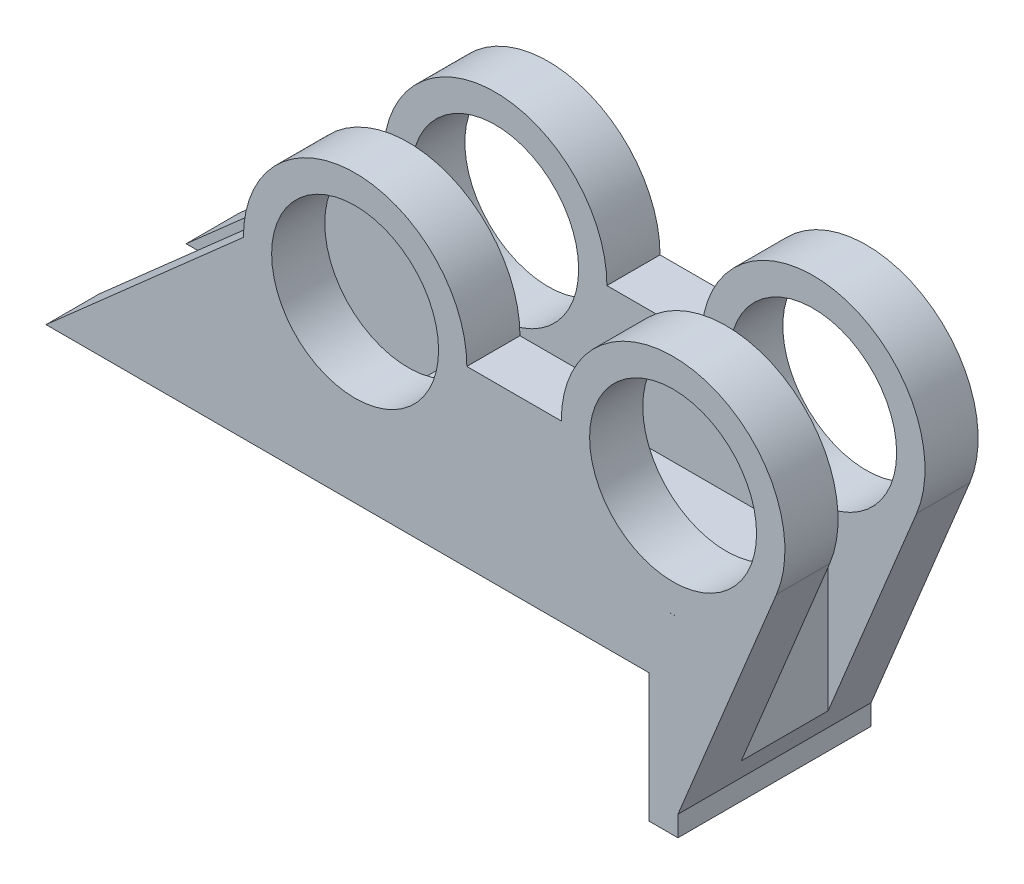
ISO-10303-21;
HEADER;
FILE_DESCRIPTION(('STEP AP214'),'2;1');
FILE_NAME('part.step','',(''),(''),'','','');
FILE_SCHEMA(('AUTOMOTIVE_DESIGN { 1 0 10303 214 1 1 1 1 }'));
ENDSEC;
DATA;
#1=APPLICATION_CONTEXT('core data for automotive mechanical design processes');
#2=APPLICATION_PROTOCOL_DEFINITION('international standard','automotive_design',2000,#1);
#3=PRODUCT_CONTEXT('',#1,'mechanical');
#4=PRODUCT('Part','Part','',(#3));
#5=PRODUCT_RELATED_PRODUCT_CATEGORY('part','',(#4));
#6=PRODUCT_DEFINITION_FORMATION('','',#4);
#7=PRODUCT_DEFINITION_CONTEXT('part definition',#1,'design');
#8=PRODUCT_DEFINITION('design','',#6,#7);
#9=PRODUCT_DEFINITION_SHAPE('','',#8);
#10=(LENGTH_UNIT() NAMED_UNIT(*) SI_UNIT(.MILLI.,.METRE.));
#11=(NAMED_UNIT(*) PLANE_ANGLE_UNIT() SI_UNIT($,.RADIAN.));
#12=(NAMED_UNIT(*) SI_UNIT($,.STERADIAN.) SOLID_ANGLE_UNIT());
#13=UNCERTAINTY_MEASURE_WITH_UNIT(LENGTH_MEASURE(1.E-05),#10,'distance_accuracy_value','');
#14=(GEOMETRIC_REPRESENTATION_CONTEXT(3) GLOBAL_UNCERTAINTY_ASSIGNED_CONTEXT((#13)) GLOBAL_UNIT_ASSIGNED_CONTEXT((#10,
#11,#12)) REPRESENTATION_CONTEXT('',''));
#15=CARTESIAN_POINT('',(0.,0.,0.));
#16=DIRECTION('',(0.,0.,1.));
#17=DIRECTION('',(1.,0.,0.));
#18=AXIS2_PLACEMENT_3D('',#15,#16,#17);
#19=CARTESIAN_POINT('',(-28.5338297114202,32.3262462591213,25.4));
#20=DIRECTION('',(0.661760778149654,-0.749715060874973,0.));
#21=DIRECTION('',(0.749715060874973,0.661760778149654,0.));
#22=AXIS2_PLACEMENT_3D('',#19,#20,#21);
#23=PLANE('',#22);
#24=DIRECTION('',(0.749715060874973,0.661760778149654,0.));
#25=VECTOR('',#24,1.);
#26=CARTESIAN_POINT('',(-28.5338297114202,32.3262462591213,18.415));
#27=LINE('',#26,#25);
#28=CARTESIAN_POINT('',(-45.8915533275694,17.0048777998512,18.415));
#29=VERTEX_POINT('',#28);
#30=CARTESIAN_POINT('',(-19.9469963419217,39.9056985457125,18.415));
#31=VERTEX_POINT('',#30);
#32=EDGE_CURVE('E385',#29,#31,#27,.T.);
#33=ORIENTED_EDGE('',*,*,#32,.F.);
#34=DIRECTION('',(0.,0.,-1.));
#35=VECTOR('',#34,1.);
#36=CARTESIAN_POINT('',(-45.8915533275694,17.0048777998512,25.4));
#37=LINE('',#36,#35);
#38=CARTESIAN_POINT('',(-45.8915533275694,17.0048777998512,25.4));
#39=VERTEX_POINT('',#38);
#40=EDGE_CURVE('E278',#39,#29,#37,.T.);
#41=ORIENTED_EDGE('',*,*,#40,.F.);
#42=DIRECTION('',(-0.749715060874973,-0.661760778149654,0.));
#43=VECTOR('',#42,1.);
#44=CARTESIAN_POINT('',(-28.5338297114202,32.3262462591213,25.4));
#45=LINE('',#44,#43);
#46=CARTESIAN_POINT('',(-19.9469963419217,39.9056985457125,25.4));
#47=VERTEX_POINT('',#46);
#48=EDGE_CURVE('E441',#47,#39,#45,.T.);
#49=ORIENTED_EDGE('',*,*,#48,.F.);
#50=CARTESIAN_POINT('',(-19.9469963419217,39.9056985457125,25.4));
#51=DIRECTION('',(0.,0.,-1.));
#52=VECTOR('',#51,1.);
#53=LINE('',#50,#52);
#54=EDGE_CURVE('E559',#47,#31,#53,.T.);
#55=ORIENTED_EDGE('',*,*,#54,.T.);
#56=EDGE_LOOP('',(#33,#41,#49,#55));
#57=FACE_BOUND('',#56,.T.);
#58=ADVANCED_FACE('F101',(#57),#23,.F.);
#59=CARTESIAN_POINT('',(-45.8915533275694,17.0048777998512,6.985));
#60=VERTEX_POINT('',#59);
#61=CARTESIAN_POINT('',(-45.8915533275694,17.0048777998512,0.));
#62=VERTEX_POINT('',#61);
#63=EDGE_CURVE('E535',#60,#62,#37,.T.);
#64=ORIENTED_EDGE('',*,*,#63,.F.);
#65=DIRECTION('',(-0.749715060874973,-0.661760778149654,0.));
#66=VECTOR('',#65,1.);
#67=CARTESIAN_POINT('',(-28.5338297114202,32.3262462591213,6.985));
#68=LINE('',#67,#66);
#69=CARTESIAN_POINT('',(-19.9469963419217,39.9056985457125,6.985));
#70=VERTEX_POINT('',#69);
#71=EDGE_CURVE('E352',#70,#60,#68,.T.);
#72=ORIENTED_EDGE('',*,*,#71,.F.);
#73=CARTESIAN_POINT('',(-19.9469963419217,39.9056985457125,6.985));
#74=DIRECTION('',(0.,0.,-1.));
#75=VECTOR('',#74,1.);
#76=LINE('',#73,#75);
#77=CARTESIAN_POINT('',(-19.9469963419217,39.9056985457125,0.));
#78=VERTEX_POINT('',#77);
#79=EDGE_CURVE('E538',#70,#78,#76,.T.);
#80=ORIENTED_EDGE('',*,*,#79,.T.);
#81=DIRECTION('',(-0.749715060874973,-0.661760778149654,0.));
#82=VECTOR('',#81,1.);
#83=CARTESIAN_POINT('',(-28.5338297114202,32.3262462591213,0.));
#84=LINE('',#83,#82);
#85=EDGE_CURVE('E484',#78,#62,#84,.T.);
#86=ORIENTED_EDGE('',*,*,#85,.T.);
#87=EDGE_LOOP('',(#64,#72,#80,#86));
#88=FACE_BOUND('',#87,.T.);
#89=ADVANCED_FACE('F575',(#88),#23,.F.);
#90=CARTESIAN_POINT('',(0.,17.0048777998512,25.4));
#91=DIRECTION('',(0.,1.,0.));
#92=DIRECTION('',(0.,0.,1.));
#93=AXIS2_PLACEMENT_3D('',#90,#91,#92);
#94=PLANE('',#93);
#95=CARTESIAN_POINT('',(16.208214309476,17.0048777998512,12.7));
#96=DIRECTION('',(0.,1.,0.));
#97=DIRECTION('',(0.,0.,1.));
#98=AXIS2_PLACEMENT_3D('',#95,#96,#97);
#99=CIRCLE('',#98,2.15265000000001);
#100=CARTESIAN_POINT('',(16.208214309476,17.0048777998512,14.85265));
#101=VERTEX_POINT('',#100);
#102=EDGE_CURVE('E333',#101,#101,#99,.T.);
#103=ORIENTED_EDGE('',*,*,#102,.T.);
#104=EDGE_LOOP('',(#103));
#105=FACE_BOUND('',#104,.T.);
#106=CARTESIAN_POINT('',(2.23670916964207,17.0048777998512,12.7));
#107=DIRECTION('',(0.,1.,0.));
#108=DIRECTION('',(0.,0.,1.));
#109=AXIS2_PLACEMENT_3D('',#106,#107,#108);
#110=CIRCLE('',#109,2.15265);
#111=CARTESIAN_POINT('',(2.23670916964207,17.0048777998512,14.85265));
#112=VERTEX_POINT('',#111);
#113=EDGE_CURVE('E317',#112,#112,#110,.T.);
#114=ORIENTED_EDGE('',*,*,#113,.T.);
#115=EDGE_LOOP('',(#114));
#116=FACE_BOUND('',#115,.T.);
#117=DIRECTION('',(-1.,0.,0.));
#118=VECTOR('',#117,1.);
#119=CARTESIAN_POINT('',(-7.79155332756939,17.0048777998512,18.415));
#120=LINE('',#119,#118);
#121=CARTESIAN_POINT('',(-7.79155332756939,17.0048777998512,18.415));
#122=VERTEX_POINT('',#121);
#123=EDGE_CURVE('E270',#122,#29,#120,.T.);
#124=ORIENTED_EDGE('',*,*,#123,.F.);
#125=DIRECTION('',(0.,0.,-1.));
#126=VECTOR('',#125,1.);
#127=CARTESIAN_POINT('',(-7.79155332756939,17.0048777998512,18.415));
#128=LINE('',#127,#126);
#129=CARTESIAN_POINT('',(-7.79155332756939,17.0048777998512,6.985));
#130=VERTEX_POINT('',#129);
#131=EDGE_CURVE('E255',#122,#130,#128,.T.);
#132=ORIENTED_EDGE('',*,*,#131,.T.);
#133=DIRECTION('',(-1.,0.,0.));
#134=VECTOR('',#133,1.);
#135=CARTESIAN_POINT('',(-7.79155332756939,17.0048777998512,6.985));
#136=LINE('',#135,#134);
#137=EDGE_CURVE('E281',#130,#60,#136,.T.);
#138=ORIENTED_EDGE('',*,*,#137,.T.);
#139=ORIENTED_EDGE('',*,*,#63,.T.);
#140=DIRECTION('',(1.,0.,0.));
#141=VECTOR('',#140,1.);
#142=CARTESIAN_POINT('',(0.,17.0048777998512,0.));
#143=LINE('',#142,#141);
#144=CARTESIAN_POINT('',(33.3468116780541,17.0048777998512,0.));
#145=VERTEX_POINT('',#144);
#146=EDGE_CURVE('E490',#62,#145,#143,.T.);
#147=ORIENTED_EDGE('',*,*,#146,.T.);
#148=DIRECTION('',(0.,0.,-1.));
#149=VECTOR('',#148,1.);
#150=CARTESIAN_POINT('',(33.3468116780541,17.0048777998512,25.4));
#151=LINE('',#150,#149);
#152=CARTESIAN_POINT('',(33.3468116780541,17.0048777998512,25.4));
#153=VERTEX_POINT('',#152);
#154=EDGE_CURVE('E531',#153,#145,#151,.T.);
#155=ORIENTED_EDGE('',*,*,#154,.F.);
#156=DIRECTION('',(1.,0.,0.));
#157=VECTOR('',#156,1.);
#158=CARTESIAN_POINT('',(0.,17.0048777998512,25.4));
#159=LINE('',#158,#157);
#160=EDGE_CURVE('E446',#39,#153,#159,.T.);
#161=ORIENTED_EDGE('',*,*,#160,.F.);
#162=ORIENTED_EDGE('',*,*,#40,.T.);
#163=EDGE_LOOP('',(#124,#132,#138,#139,#147,#155,#161,#162));
#164=FACE_BOUND('',#163,.T.);
#165=ADVANCED_FACE('F275',(#105,#116,#164),#94,.F.);
#166=CARTESIAN_POINT('',(36.5449047795208,39.9056985457125,25.4));
#167=DIRECTION('',(0.,0.,-1.));
#168=DIRECTION('',(-1.,0.,0.));
#169=AXIS2_PLACEMENT_3D('',#166,#167,#168);
#170=CYLINDRICAL_SURFACE('',#169,14.7023778039538);
#171=DIRECTION('',(0.,0.,-1.));
#172=VECTOR('',#171,1.);
#173=CARTESIAN_POINT('',(37.182732386583,25.217162572585,25.4));
#174=LINE('',#173,#172);
#175=CARTESIAN_POINT('',(37.182732386583,25.217162572585,25.4));
#176=VERTEX_POINT('',#175);
#177=CARTESIAN_POINT('',(37.182732386583,25.217162572585,18.415));
#178=VERTEX_POINT('',#177);
#179=EDGE_CURVE('E511',#176,#178,#174,.T.);
#180=ORIENTED_EDGE('',*,*,#179,.T.);
#181=CARTESIAN_POINT('',(36.5449047795208,39.9056985457125,18.415));
#182=DIRECTION('',(0.,0.,-1.));
#183=DIRECTION('',(-1.,0.,0.));
#184=AXIS2_PLACEMENT_3D('',#181,#182,#183);
#185=CIRCLE('',#184,14.7023778039538);
#186=CARTESIAN_POINT('',(35.9070771724585,25.217162572585,18.415));
#187=VERTEX_POINT('',#186);
#188=EDGE_CURVE('E381',#178,#187,#185,.T.);
#189=ORIENTED_EDGE('',*,*,#188,.T.);
#190=DIRECTION('',(0.,0.,-1.));
#191=VECTOR('',#190,1.);
#192=CARTESIAN_POINT('',(35.9070771724585,25.217162572585,25.4));
#193=LINE('',#192,#191);
#194=CARTESIAN_POINT('',(35.9070771724585,25.217162572585,25.4));
#195=VERTEX_POINT('',#194);
#196=EDGE_CURVE('E110',#195,#187,#193,.T.);
#197=ORIENTED_EDGE('',*,*,#196,.F.);
#198=CARTESIAN_POINT('',(36.5449047795208,39.9056985457125,25.4));
#199=DIRECTION('',(0.,0.,1.));
#200=DIRECTION('',(1.,0.,0.));
#201=AXIS2_PLACEMENT_3D('',#198,#199,#200);
#202=CIRCLE('',#201,14.7023778039538);
#203=EDGE_CURVE('E460',#195,#176,#202,.T.);
#204=ORIENTED_EDGE('',*,*,#203,.T.);
#205=EDGE_LOOP('',(#180,#189,#197,#204));
#206=FACE_BOUND('',#205,.T.);
#207=ADVANCED_FACE('F647',(#206),#170,.F.);
#208=CARTESIAN_POINT('',(35.9070771724585,25.217162572585,6.985));
#209=VERTEX_POINT('',#208);
#210=CARTESIAN_POINT('',(35.9070771724585,25.217162572585,0.));
#211=VERTEX_POINT('',#210);
#212=EDGE_CURVE('E515',#209,#211,#193,.T.);
#213=ORIENTED_EDGE('',*,*,#212,.F.);
#214=CARTESIAN_POINT('',(36.5449047795208,39.9056985457125,6.985));
#215=DIRECTION('',(0.,0.,1.));
#216=DIRECTION('',(1.,0.,0.));
#217=AXIS2_PLACEMENT_3D('',#214,#215,#216);
#218=CIRCLE('',#217,14.7023778039538);
#219=CARTESIAN_POINT('',(37.182732386583,25.217162572585,6.985));
#220=VERTEX_POINT('',#219);
#221=EDGE_CURVE('E124',#209,#220,#218,.T.);
#222=ORIENTED_EDGE('',*,*,#221,.T.);
#223=CARTESIAN_POINT('',(37.182732386583,25.217162572585,0.));
#224=VERTEX_POINT('',#223);
#225=EDGE_CURVE('E516',#220,#224,#174,.T.);
#226=ORIENTED_EDGE('',*,*,#225,.T.);
#227=CARTESIAN_POINT('',(36.5449047795208,39.9056985457125,0.));
#228=DIRECTION('',(0.,0.,1.));
#229=DIRECTION('',(1.,0.,0.));
#230=AXIS2_PLACEMENT_3D('',#227,#228,#229);
#231=CIRCLE('',#230,14.7023778039538);
#232=EDGE_CURVE('E504',#211,#224,#231,.T.);
#233=ORIENTED_EDGE('',*,*,#232,.F.);
#234=EDGE_LOOP('',(#213,#222,#226,#233));
#235=FACE_BOUND('',#234,.T.);
#236=ADVANCED_FACE('F650',(#235),#170,.F.);
#237=CARTESIAN_POINT('',(30.8177012280412,-12.6743008818562,25.4));
#238=DIRECTION('',(-0.924840100384332,0.380356134065298,0.));
#239=DIRECTION('',(-0.380356134065298,-0.924840100384332,0.));
#240=AXIS2_PLACEMENT_3D('',#237,#238,#239);
#241=PLANE('',#240);
#242=DIRECTION('',(0.,0.,1.));
#243=VECTOR('',#242,1.);
#244=CARTESIAN_POINT('',(38.5122135321154,6.03498994947491,25.4));
#245=LINE('',#244,#243);
#246=CARTESIAN_POINT('',(38.5122135321154,6.03498994947492,6.985));
#247=VERTEX_POINT('',#246);
#248=CARTESIAN_POINT('',(38.5122135321154,6.03498994947491,18.4057659659719));
#249=VERTEX_POINT('',#248);
#250=EDGE_CURVE('E297',#247,#249,#245,.T.);
#251=ORIENTED_EDGE('',*,*,#250,.T.);
#252=DIRECTION('',(0.380356134065298,0.924840100384332,0.));
#253=VECTOR('',#252,1.);
#254=CARTESIAN_POINT('',(30.8177012280412,-12.6743008818562,18.4057659659719));
#255=LINE('',#254,#253);
#256=CARTESIAN_POINT('',(45.9831470184491,24.2006464399243,18.4057659659719));
#257=VERTEX_POINT('',#256);
#258=EDGE_CURVE('E301',#249,#257,#255,.T.);
#259=ORIENTED_EDGE('',*,*,#258,.T.);
#260=DIRECTION('',(0.,0.,-1.));
#261=VECTOR('',#260,1.);
#262=CARTESIAN_POINT('',(45.9831470184491,24.2006464399243,25.4));
#263=LINE('',#262,#261);
#264=CARTESIAN_POINT('',(45.9831470184491,24.2006464399243,18.415));
#265=VERTEX_POINT('',#264);
#266=EDGE_CURVE('E405',#265,#257,#263,.T.);
#267=ORIENTED_EDGE('',*,*,#266,.F.);
#268=DIRECTION('',(-0.380356134065298,-0.924840100384332,0.));
#269=VECTOR('',#268,1.);
#270=CARTESIAN_POINT('',(30.8177012280412,-12.6743008818562,18.415));
#271=LINE('',#270,#269);
#272=CARTESIAN_POINT('',(50.1422533436178,34.3135589626332,18.415));
#273=VERTEX_POINT('',#272);
#274=EDGE_CURVE('E402',#273,#265,#271,.T.);
#275=ORIENTED_EDGE('',*,*,#274,.F.);
#276=DIRECTION('',(0.,0.,-1.));
#277=VECTOR('',#276,1.);
#278=CARTESIAN_POINT('',(50.1422533436178,34.3135589626332,25.4));
#279=LINE('',#278,#277);
#280=CARTESIAN_POINT('',(50.1422533436178,34.3135589626332,25.4));
#281=VERTEX_POINT('',#280);
#282=EDGE_CURVE('E550',#281,#273,#279,.T.);
#283=ORIENTED_EDGE('',*,*,#282,.F.);
#284=DIRECTION('',(0.380356134065298,0.924840100384332,0.));
#285=VECTOR('',#284,1.);
#286=CARTESIAN_POINT('',(30.8177012280412,-12.6743008818562,25.4));
#287=LINE('',#286,#285);
#288=CARTESIAN_POINT('',(37.182732386583,2.80234200200625,25.4));
#289=VERTEX_POINT('',#288);
#290=EDGE_CURVE('E426',#289,#281,#287,.T.);
#291=ORIENTED_EDGE('',*,*,#290,.F.);
#292=DIRECTION('',(0.,0.,-1.));
#293=VECTOR('',#292,1.);
#294=CARTESIAN_POINT('',(37.182732386583,2.80234200200625,25.4));
#295=LINE('',#294,#293);
#296=CARTESIAN_POINT('',(37.182732386583,2.80234200200625,0.));
#297=VERTEX_POINT('',#296);
#298=EDGE_CURVE('E468',#289,#297,#295,.T.);
#299=ORIENTED_EDGE('',*,*,#298,.T.);
#300=DIRECTION('',(0.380356134065298,0.924840100384332,0.));
#301=VECTOR('',#300,1.);
#302=CARTESIAN_POINT('',(30.8177012280412,-12.6743008818562,0.));
#303=LINE('',#302,#301);
#304=CARTESIAN_POINT('',(50.1422533436178,34.3135589626332,0.));
#305=VERTEX_POINT('',#304);
#306=EDGE_CURVE('E422',#297,#305,#303,.T.);
#307=ORIENTED_EDGE('',*,*,#306,.T.);
#308=CARTESIAN_POINT('',(50.1422533436178,34.3135589626332,6.985));
#309=VERTEX_POINT('',#308);
#310=EDGE_CURVE('E549',#309,#305,#279,.T.);
#311=ORIENTED_EDGE('',*,*,#310,.F.);
#312=DIRECTION('',(0.380356134065298,0.924840100384332,0.));
#313=VECTOR('',#312,1.);
#314=CARTESIAN_POINT('',(30.8177012280412,-12.6743008818562,6.985));
#315=LINE('',#314,#313);
#316=EDGE_CURVE('E369',#247,#309,#315,.T.);
#317=ORIENTED_EDGE('',*,*,#316,.F.);
#318=EDGE_LOOP('',(#251,#259,#267,#275,#283,#291,#299,#307,#311,#317));
#319=FACE_BOUND('',#318,.T.);
#320=ADVANCED_FACE('F103',(#319),#241,.F.);
#321=CARTESIAN_POINT('',(36.5449047795208,39.9056985457125,25.4));
#322=DIRECTION('',(0.,0.,-1.));
#323=DIRECTION('',(-1.,0.,0.));
#324=AXIS2_PLACEMENT_3D('',#321,#322,#323);
#325=CYLINDRICAL_SURFACE('',#324,14.7023778039538);
#326=CARTESIAN_POINT('',(36.5449047795208,39.9056985457125,18.415));
#327=DIRECTION('',(0.,0.,-1.));
#328=DIRECTION('',(-1.,0.,0.));
#329=AXIS2_PLACEMENT_3D('',#326,#327,#328);
#330=CIRCLE('',#329,14.7023778039538);
#331=CARTESIAN_POINT('',(21.842526975567,39.9056985457125,18.415));
#332=VERTEX_POINT('',#331);
#333=EDGE_CURVE('E399',#332,#273,#330,.T.);
#334=ORIENTED_EDGE('',*,*,#333,.F.);
#335=DIRECTION('',(0.,0.,-1.));
#336=VECTOR('',#335,1.);
#337=CARTESIAN_POINT('',(21.842526975567,39.9056985457125,25.4));
#338=LINE('',#337,#336);
#339=CARTESIAN_POINT('',(21.842526975567,39.9056985457125,25.4));
#340=VERTEX_POINT('',#339);
#341=EDGE_CURVE('E545',#340,#332,#338,.T.);
#342=ORIENTED_EDGE('',*,*,#341,.F.);
#343=CARTESIAN_POINT('',(36.5449047795208,39.9056985457125,25.4));
#344=DIRECTION('',(0.,0.,1.));
#345=DIRECTION('',(1.,0.,0.));
#346=AXIS2_PLACEMENT_3D('',#343,#344,#345);
#347=CIRCLE('',#346,14.7023778039538);
#348=EDGE_CURVE('E430',#281,#340,#347,.T.);
#349=ORIENTED_EDGE('',*,*,#348,.F.);
#350=ORIENTED_EDGE('',*,*,#282,.T.);
#351=EDGE_LOOP('',(#334,#342,#349,#350));
#352=FACE_BOUND('',#351,.T.);
#353=ADVANCED_FACE('F782',(#352),#325,.T.);
#354=CARTESIAN_POINT('',(21.842526975567,39.9056985457125,6.985));
#355=VERTEX_POINT('',#354);
#356=CARTESIAN_POINT('',(21.842526975567,39.9056985457125,0.));
#357=VERTEX_POINT('',#356);
#358=EDGE_CURVE('E543',#355,#357,#338,.T.);
#359=ORIENTED_EDGE('',*,*,#358,.F.);
#360=CARTESIAN_POINT('',(36.5449047795208,39.9056985457125,6.985));
#361=DIRECTION('',(0.,0.,1.));
#362=DIRECTION('',(1.,0.,0.));
#363=AXIS2_PLACEMENT_3D('',#360,#361,#362);
#364=CIRCLE('',#363,14.7023778039538);
#365=EDGE_CURVE('E366',#309,#355,#364,.T.);
#366=ORIENTED_EDGE('',*,*,#365,.F.);
#367=ORIENTED_EDGE('',*,*,#310,.T.);
#368=CARTESIAN_POINT('',(36.5449047795208,39.9056985457125,0.));
#369=DIRECTION('',(0.,0.,1.));
#370=DIRECTION('',(1.,0.,0.));
#371=AXIS2_PLACEMENT_3D('',#368,#369,#370);
#372=CIRCLE('',#371,14.7023778039538);
#373=EDGE_CURVE('E472',#305,#357,#372,.T.);
#374=ORIENTED_EDGE('',*,*,#373,.T.);
#375=EDGE_LOOP('',(#359,#366,#367,#374));
#376=FACE_BOUND('',#375,.T.);
#377=ADVANCED_FACE('F787',(#376),#325,.T.);
#378=CARTESIAN_POINT('',(0.,39.9056985457125,25.4));
#379=DIRECTION('',(0.,1.,0.));
#380=DIRECTION('',(-1.,0.,0.));
#381=AXIS2_PLACEMENT_3D('',#378,#379,#380);
#382=PLANE('',#381);
#383=ORIENTED_EDGE('',*,*,#341,.T.);
#384=DIRECTION('',(-1.,0.,0.));
#385=VECTOR('',#384,1.);
#386=CARTESIAN_POINT('',(0.,39.9056985457125,18.415));
#387=LINE('',#386,#385);
#388=CARTESIAN_POINT('',(9.43082191306635,39.9056985457125,18.415));
#389=VERTEX_POINT('',#388);
#390=EDGE_CURVE('E393',#332,#389,#387,.T.);
#391=ORIENTED_EDGE('',*,*,#390,.T.);
#392=DIRECTION('',(0.,0.,-1.));
#393=VECTOR('',#392,1.);
#394=CARTESIAN_POINT('',(9.43082191306635,39.9056985457125,25.4));
#395=LINE('',#394,#393);
#396=CARTESIAN_POINT('',(9.43082191306635,39.9056985457125,25.4));
#397=VERTEX_POINT('',#396);
#398=EDGE_CURVE('E539',#397,#389,#395,.T.);
#399=ORIENTED_EDGE('',*,*,#398,.F.);
#400=DIRECTION('',(1.,0.,0.));
#401=VECTOR('',#400,1.);
#402=CARTESIAN_POINT('',(0.,39.9056985457125,25.4));
#403=LINE('',#402,#401);
#404=EDGE_CURVE('E434',#397,#340,#403,.T.);
#405=ORIENTED_EDGE('',*,*,#404,.T.);
#406=EDGE_LOOP('',(#383,#391,#399,#405));
#407=FACE_BOUND('',#406,.T.);
#408=ADVANCED_FACE('F584',(#407),#382,.T.);
#409=CARTESIAN_POINT('',(9.43082191306635,39.9056985457125,6.985));
#410=VERTEX_POINT('',#409);
#411=CARTESIAN_POINT('',(9.43082191306635,39.9056985457125,0.));
#412=VERTEX_POINT('',#411);
#413=EDGE_CURVE('E544',#410,#412,#395,.T.);
#414=ORIENTED_EDGE('',*,*,#413,.F.);
#415=DIRECTION('',(1.,0.,0.));
#416=VECTOR('',#415,1.);
#417=CARTESIAN_POINT('',(0.,39.9056985457125,6.985));
#418=LINE('',#417,#416);
#419=EDGE_CURVE('E360',#410,#355,#418,.T.);
#420=ORIENTED_EDGE('',*,*,#419,.T.);
#421=ORIENTED_EDGE('',*,*,#358,.T.);
#422=DIRECTION('',(1.,0.,0.));
#423=VECTOR('',#422,1.);
#424=CARTESIAN_POINT('',(0.,39.9056985457125,0.));
#425=LINE('',#424,#423);
#426=EDGE_CURVE('E476',#412,#357,#425,.T.);
#427=ORIENTED_EDGE('',*,*,#426,.F.);
#428=EDGE_LOOP('',(#414,#420,#421,#427));
#429=FACE_BOUND('',#428,.T.);
#430=ADVANCED_FACE('F582',(#429),#382,.T.);
#431=CARTESIAN_POINT('',(-5.2580872144277,39.9056985457125,25.4));
#432=DIRECTION('',(0.,0.,-1.));
#433=DIRECTION('',(-1.,0.,0.));
#434=AXIS2_PLACEMENT_3D('',#431,#432,#433);
#435=CYLINDRICAL_SURFACE('',#434,14.688909127494);
#436=CARTESIAN_POINT('',(-5.2580872144277,39.9056985457125,18.415));
#437=DIRECTION('',(0.,0.,-1.));
#438=DIRECTION('',(-1.,0.,0.));
#439=AXIS2_PLACEMENT_3D('',#436,#437,#438);
#440=CIRCLE('',#439,14.688909127494);
#441=EDGE_CURVE('E388',#31,#389,#440,.T.);
#442=ORIENTED_EDGE('',*,*,#441,.F.);
#443=ORIENTED_EDGE('',*,*,#54,.F.);
#444=CARTESIAN_POINT('',(-5.2580872144277,39.9056985457125,25.4));
#445=DIRECTION('',(0.,0.,1.));
#446=DIRECTION('',(1.,0.,0.));
#447=AXIS2_PLACEMENT_3D('',#444,#445,#446);
#448=CIRCLE('',#447,14.688909127494);
#449=EDGE_CURVE('E438',#397,#47,#448,.T.);
#450=ORIENTED_EDGE('',*,*,#449,.F.);
#451=ORIENTED_EDGE('',*,*,#398,.T.);
#452=EDGE_LOOP('',(#442,#443,#450,#451));
#453=FACE_BOUND('',#452,.T.);
#454=ADVANCED_FACE('F577',(#453),#435,.T.);
#455=CARTESIAN_POINT('',(-5.2580872144277,39.9056985457125,6.985));
#456=DIRECTION('',(0.,0.,1.));
#457=DIRECTION('',(1.,0.,0.));
#458=AXIS2_PLACEMENT_3D('',#455,#456,#457);
#459=CIRCLE('',#458,14.688909127494);
#460=EDGE_CURVE('E355',#410,#70,#459,.T.);
#461=ORIENTED_EDGE('',*,*,#460,.F.);
#462=ORIENTED_EDGE('',*,*,#413,.T.);
#463=CARTESIAN_POINT('',(-5.2580872144277,39.9056985457125,0.));
#464=DIRECTION('',(0.,0.,1.));
#465=DIRECTION('',(1.,0.,0.));
#466=AXIS2_PLACEMENT_3D('',#463,#464,#465);
#467=CIRCLE('',#466,14.688909127494);
#468=EDGE_CURVE('E480',#412,#78,#467,.T.);
#469=ORIENTED_EDGE('',*,*,#468,.T.);
#470=ORIENTED_EDGE('',*,*,#79,.F.);
#471=EDGE_LOOP('',(#461,#462,#469,#470));
#472=FACE_BOUND('',#471,.T.);
#473=ADVANCED_FACE('F581',(#472),#435,.T.);
#474=CARTESIAN_POINT('',(0.,25.217162572585,25.4));
#475=DIRECTION('',(0.,-1.,0.));
#476=DIRECTION('',(0.,0.,-1.));
#477=AXIS2_PLACEMENT_3D('',#474,#475,#476);
#478=PLANE('',#477);
#479=ORIENTED_EDGE('',*,*,#196,.T.);
#480=DIRECTION('',(1.,0.,0.));
#481=VECTOR('',#480,1.);
#482=CARTESIAN_POINT('',(0.,25.217162572585,18.415));
#483=LINE('',#482,#481);
#484=EDGE_CURVE('E377',#187,#178,#483,.T.);
#485=ORIENTED_EDGE('',*,*,#484,.T.);
#486=ORIENTED_EDGE('',*,*,#179,.F.);
#487=DIRECTION('',(-1.,0.,0.));
#488=VECTOR('',#487,1.);
#489=CARTESIAN_POINT('',(0.,25.217162572585,25.4));
#490=LINE('',#489,#488);
#491=EDGE_CURVE('E464',#176,#195,#490,.T.);
#492=ORIENTED_EDGE('',*,*,#491,.T.);
#493=EDGE_LOOP('',(#479,#485,#486,#492));
#494=FACE_BOUND('',#493,.T.);
#495=ADVANCED_FACE('F643',(#494),#478,.T.);
#496=ORIENTED_EDGE('',*,*,#225,.F.);
#497=DIRECTION('',(-1.,0.,0.));
#498=VECTOR('',#497,1.);
#499=CARTESIAN_POINT('',(0.,25.217162572585,6.985));
#500=LINE('',#499,#498);
#501=EDGE_CURVE('E347',#220,#209,#500,.T.);
#502=ORIENTED_EDGE('',*,*,#501,.T.);
#503=ORIENTED_EDGE('',*,*,#212,.T.);
#504=DIRECTION('',(-1.,0.,0.));
#505=VECTOR('',#504,1.);
#506=CARTESIAN_POINT('',(0.,25.217162572585,0.));
#507=LINE('',#506,#505);
#508=EDGE_CURVE('E431',#224,#211,#507,.T.);
#509=ORIENTED_EDGE('',*,*,#508,.F.);
#510=EDGE_LOOP('',(#496,#502,#503,#509));
#511=FACE_BOUND('',#510,.T.);
#512=ADVANCED_FACE('F632',(#511),#478,.T.);
#513=CARTESIAN_POINT('',(-5.2580872144277,39.9056985457125,25.4));
#514=DIRECTION('',(0.,0.,-1.));
#515=DIRECTION('',(-1.,0.,0.));
#516=AXIS2_PLACEMENT_3D('',#513,#514,#515);
#517=CYLINDRICAL_SURFACE('',#516,10.9728);
#518=CARTESIAN_POINT('',(-5.2580872144277,39.9056985457125,25.4));
#519=DIRECTION('',(0.,0.,1.));
#520=DIRECTION('',(1.,0.,0.));
#521=AXIS2_PLACEMENT_3D('',#518,#519,#520);
#522=CIRCLE('',#521,10.9728);
#523=CARTESIAN_POINT('',(5.7147127855723,39.9056985457125,25.4));
#524=VERTEX_POINT('',#523);
#525=EDGE_CURVE('E418',#524,#524,#522,.T.);
#526=ORIENTED_EDGE('',*,*,#525,.T.);
#527=EDGE_LOOP('',(#526));
#528=FACE_BOUND('',#527,.T.);
#529=CARTESIAN_POINT('',(-5.2580872144277,39.9056985457125,18.415));
#530=DIRECTION('',(0.,0.,-1.));
#531=DIRECTION('',(-1.,0.,0.));
#532=AXIS2_PLACEMENT_3D('',#529,#530,#531);
#533=CIRCLE('',#532,10.9728);
#534=CARTESIAN_POINT('',(-16.2308872144277,39.9056985457125,18.415));
#535=VERTEX_POINT('',#534);
#536=EDGE_CURVE('E373',#535,#535,#533,.T.);
#537=ORIENTED_EDGE('',*,*,#536,.T.);
#538=EDGE_LOOP('',(#537));
#539=FACE_BOUND('',#538,.T.);
#540=ADVANCED_FACE('F629',(#528,#539),#517,.F.);
#541=CARTESIAN_POINT('',(-5.2580872144277,39.9056985457125,0.));
#542=DIRECTION('',(0.,0.,1.));
#543=DIRECTION('',(1.,0.,0.));
#544=AXIS2_PLACEMENT_3D('',#541,#542,#543);
#545=CIRCLE('',#544,10.9728);
#546=CARTESIAN_POINT('',(5.7147127855723,39.9056985457125,0.));
#547=VERTEX_POINT('',#546);
#548=EDGE_CURVE('E414',#547,#547,#545,.T.);
#549=ORIENTED_EDGE('',*,*,#548,.F.);
#550=EDGE_LOOP('',(#549));
#551=FACE_BOUND('',#550,.T.);
#552=CARTESIAN_POINT('',(-5.2580872144277,39.9056985457125,6.985));
#553=DIRECTION('',(0.,0.,1.));
#554=DIRECTION('',(1.,0.,0.));
#555=AXIS2_PLACEMENT_3D('',#552,#553,#554);
#556=CIRCLE('',#555,10.9728);
#557=CARTESIAN_POINT('',(5.7147127855723,39.9056985457125,6.985));
#558=VERTEX_POINT('',#557);
#559=EDGE_CURVE('E343',#558,#558,#556,.T.);
#560=ORIENTED_EDGE('',*,*,#559,.T.);
#561=EDGE_LOOP('',(#560));
#562=FACE_BOUND('',#561,.T.);
#563=ADVANCED_FACE('F627',(#551,#562),#517,.F.);
#564=CARTESIAN_POINT('',(36.5449047795208,39.9056985457125,25.4));
#565=DIRECTION('',(0.,0.,-1.));
#566=DIRECTION('',(-1.,0.,0.));
#567=AXIS2_PLACEMENT_3D('',#564,#565,#566);
#568=CYLINDRICAL_SURFACE('',#567,10.9728);
#569=CARTESIAN_POINT('',(36.5449047795208,39.9056985457125,25.4));
#570=DIRECTION('',(0.,0.,1.));
#571=DIRECTION('',(1.,0.,0.));
#572=AXIS2_PLACEMENT_3D('',#569,#570,#571);
#573=CIRCLE('',#572,10.9728);
#574=CARTESIAN_POINT('',(47.5177047795208,39.9056985457125,25.4));
#575=VERTEX_POINT('',#574);
#576=EDGE_CURVE('E410',#575,#575,#573,.T.);
#577=ORIENTED_EDGE('',*,*,#576,.T.);
#578=EDGE_LOOP('',(#577));
#579=FACE_BOUND('',#578,.T.);
#580=CARTESIAN_POINT('',(36.5449047795208,39.9056985457125,18.415));
#581=DIRECTION('',(0.,0.,-1.));
#582=DIRECTION('',(-1.,0.,0.));
#583=AXIS2_PLACEMENT_3D('',#580,#581,#582);
#584=CIRCLE('',#583,10.9728);
#585=CARTESIAN_POINT('',(25.5721047795208,39.9056985457125,18.415));
#586=VERTEX_POINT('',#585);
#587=EDGE_CURVE('E372',#586,#586,#584,.T.);
#588=ORIENTED_EDGE('',*,*,#587,.T.);
#589=EDGE_LOOP('',(#588));
#590=FACE_BOUND('',#589,.T.);
#591=ADVANCED_FACE('F605',(#579,#590),#568,.F.);
#592=CARTESIAN_POINT('',(36.5449047795208,39.9056985457125,0.));
#593=DIRECTION('',(0.,0.,1.));
#594=DIRECTION('',(1.,0.,0.));
#595=AXIS2_PLACEMENT_3D('',#592,#593,#594);
#596=CIRCLE('',#595,10.9728);
#597=CARTESIAN_POINT('',(47.5177047795208,39.9056985457125,0.));
#598=VERTEX_POINT('',#597);
#599=EDGE_CURVE('E409',#598,#598,#596,.T.);
#600=ORIENTED_EDGE('',*,*,#599,.F.);
#601=EDGE_LOOP('',(#600));
#602=FACE_BOUND('',#601,.T.);
#603=CARTESIAN_POINT('',(36.5449047795208,39.9056985457125,6.985));
#604=DIRECTION('',(0.,0.,1.));
#605=DIRECTION('',(1.,0.,0.));
#606=AXIS2_PLACEMENT_3D('',#603,#604,#605);
#607=CIRCLE('',#606,10.9728);
#608=CARTESIAN_POINT('',(47.5177047795208,39.9056985457125,6.985));
#609=VERTEX_POINT('',#608);
#610=EDGE_CURVE('E340',#609,#609,#607,.T.);
#611=ORIENTED_EDGE('',*,*,#610,.T.);
#612=EDGE_LOOP('',(#611));
#613=FACE_BOUND('',#612,.T.);
#614=ADVANCED_FACE('F626',(#602,#613),#568,.F.);
#615=CARTESIAN_POINT('',(0.,0.,25.4));
#616=DIRECTION('',(0.,0.,1.));
#617=DIRECTION('',(1.,0.,0.));
#618=AXIS2_PLACEMENT_3D('',#615,#616,#617);
#619=PLANE('',#618);
#620=ORIENTED_EDGE('',*,*,#525,.F.);
#621=EDGE_LOOP('',(#620));
#622=FACE_BOUND('',#621,.T.);
#623=ORIENTED_EDGE('',*,*,#290,.T.);
#624=ORIENTED_EDGE('',*,*,#348,.T.);
#625=ORIENTED_EDGE('',*,*,#404,.F.);
#626=ORIENTED_EDGE('',*,*,#449,.T.);
#627=ORIENTED_EDGE('',*,*,#48,.T.);
#628=ORIENTED_EDGE('',*,*,#160,.T.);
#629=DIRECTION('',(0.,-1.,0.));
#630=VECTOR('',#629,1.);
#631=CARTESIAN_POINT('',(33.3468116780541,0.,25.4));
#632=LINE('',#631,#630);
#633=CARTESIAN_POINT('',(33.3468116780541,0.114888998297147,25.4));
#634=VERTEX_POINT('',#633);
#635=EDGE_CURVE('E451',#153,#634,#632,.T.);
#636=ORIENTED_EDGE('',*,*,#635,.T.);
#637=DIRECTION('',(1.,0.,0.));
#638=VECTOR('',#637,1.);
#639=CARTESIAN_POINT('',(0.,0.114888998297147,25.4));
#640=LINE('',#639,#638);
#641=CARTESIAN_POINT('',(37.182732386583,0.114888998297147,25.4));
#642=VERTEX_POINT('',#641);
#643=EDGE_CURVE('E454',#634,#642,#640,.T.);
#644=ORIENTED_EDGE('',*,*,#643,.T.);
#645=DIRECTION('',(0.,1.,0.));
#646=VECTOR('',#645,1.);
#647=CARTESIAN_POINT('',(37.182732386583,0.,25.4));
#648=LINE('',#647,#646);
#649=EDGE_CURVE('E457',#642,#289,#648,.T.);
#650=ORIENTED_EDGE('',*,*,#649,.T.);
#651=EDGE_LOOP('',(#623,#624,#625,#626,#627,#628,#636,#644,#650));
#652=FACE_BOUND('',#651,.T.);
#653=ORIENTED_EDGE('',*,*,#203,.F.);
#654=ORIENTED_EDGE('',*,*,#491,.F.);
#655=EDGE_LOOP('',(#653,#654));
#656=FACE_BOUND('',#655,.T.);
#657=ORIENTED_EDGE('',*,*,#576,.F.);
#658=EDGE_LOOP('',(#657));
#659=FACE_BOUND('',#658,.T.);
#660=ADVANCED_FACE('F634',(#622,#652,#656,#659),#619,.T.);
#661=CARTESIAN_POINT('',(0.,0.,0.));
#662=DIRECTION('',(0.,0.,1.));
#663=DIRECTION('',(1.,0.,0.));
#664=AXIS2_PLACEMENT_3D('',#661,#662,#663);
#665=PLANE('',#664);
#666=ORIENTED_EDGE('',*,*,#306,.F.);
#667=DIRECTION('',(0.,1.,0.));
#668=VECTOR('',#667,1.);
#669=CARTESIAN_POINT('',(37.182732386583,0.,0.));
#670=LINE('',#669,#668);
#671=CARTESIAN_POINT('',(37.182732386583,0.114888998297147,0.));
#672=VERTEX_POINT('',#671);
#673=EDGE_CURVE('E501',#672,#297,#670,.T.);
#674=ORIENTED_EDGE('',*,*,#673,.F.);
#675=DIRECTION('',(1.,0.,0.));
#676=VECTOR('',#675,1.);
#677=CARTESIAN_POINT('',(0.,0.114888998297147,0.));
#678=LINE('',#677,#676);
#679=CARTESIAN_POINT('',(33.3468116780541,0.114888998297147,0.));
#680=VERTEX_POINT('',#679);
#681=EDGE_CURVE('E498',#680,#672,#678,.T.);
#682=ORIENTED_EDGE('',*,*,#681,.F.);
#683=DIRECTION('',(0.,-1.,0.));
#684=VECTOR('',#683,1.);
#685=CARTESIAN_POINT('',(33.3468116780541,0.,0.));
#686=LINE('',#685,#684);
#687=EDGE_CURVE('E495',#145,#680,#686,.T.);
#688=ORIENTED_EDGE('',*,*,#687,.F.);
#689=ORIENTED_EDGE('',*,*,#146,.F.);
#690=ORIENTED_EDGE('',*,*,#85,.F.);
#691=ORIENTED_EDGE('',*,*,#468,.F.);
#692=ORIENTED_EDGE('',*,*,#426,.T.);
#693=ORIENTED_EDGE('',*,*,#373,.F.);
#694=EDGE_LOOP('',(#666,#674,#682,#688,#689,#690,#691,#692,#693));
#695=FACE_BOUND('',#694,.T.);
#696=ORIENTED_EDGE('',*,*,#232,.T.);
#697=ORIENTED_EDGE('',*,*,#508,.T.);
#698=EDGE_LOOP('',(#696,#697));
#699=FACE_BOUND('',#698,.T.);
#700=ORIENTED_EDGE('',*,*,#548,.T.);
#701=EDGE_LOOP('',(#700));
#702=FACE_BOUND('',#701,.T.);
#703=ORIENTED_EDGE('',*,*,#599,.T.);
#704=EDGE_LOOP('',(#703));
#705=FACE_BOUND('',#704,.T.);
#706=ADVANCED_FACE('F637',(#695,#699,#702,#705),#665,.F.);
#707=CARTESIAN_POINT('',(33.3468116780541,0.,25.4));
#708=DIRECTION('',(1.,0.,0.));
#709=DIRECTION('',(0.,0.,-1.));
#710=AXIS2_PLACEMENT_3D('',#707,#708,#709);
#711=PLANE('',#710);
#712=ORIENTED_EDGE('',*,*,#687,.T.);
#713=DIRECTION('',(0.,0.,-1.));
#714=VECTOR('',#713,1.);
#715=CARTESIAN_POINT('',(33.3468116780541,0.114888998297147,25.4));
#716=LINE('',#715,#714);
#717=EDGE_CURVE('E527',#634,#680,#716,.T.);
#718=ORIENTED_EDGE('',*,*,#717,.F.);
#719=ORIENTED_EDGE('',*,*,#635,.F.);
#720=ORIENTED_EDGE('',*,*,#154,.T.);
#721=EDGE_LOOP('',(#712,#718,#719,#720));
#722=FACE_BOUND('',#721,.T.);
#723=ADVANCED_FACE('F641',(#722),#711,.F.);
#724=CARTESIAN_POINT('',(0.,0.114888998297147,25.4));
#725=DIRECTION('',(0.,1.,0.));
#726=DIRECTION('',(0.,0.,1.));
#727=AXIS2_PLACEMENT_3D('',#724,#725,#726);
#728=PLANE('',#727);
#729=ORIENTED_EDGE('',*,*,#681,.T.);
#730=DIRECTION('',(0.,0.,-1.));
#731=VECTOR('',#730,1.);
#732=CARTESIAN_POINT('',(37.182732386583,0.114888998297147,25.4));
#733=LINE('',#732,#731);
#734=EDGE_CURVE('E523',#642,#672,#733,.T.);
#735=ORIENTED_EDGE('',*,*,#734,.F.);
#736=ORIENTED_EDGE('',*,*,#643,.F.);
#737=ORIENTED_EDGE('',*,*,#717,.T.);
#738=EDGE_LOOP('',(#729,#735,#736,#737));
#739=FACE_BOUND('',#738,.T.);
#740=ADVANCED_FACE('F654',(#739),#728,.F.);
#741=CARTESIAN_POINT('',(37.182732386583,0.,25.4));
#742=DIRECTION('',(-1.,0.,0.));
#743=DIRECTION('',(0.,0.,1.));
#744=AXIS2_PLACEMENT_3D('',#741,#742,#743);
#745=PLANE('',#744);
#746=ORIENTED_EDGE('',*,*,#673,.T.);
#747=ORIENTED_EDGE('',*,*,#298,.F.);
#748=ORIENTED_EDGE('',*,*,#649,.F.);
#749=ORIENTED_EDGE('',*,*,#734,.T.);
#750=EDGE_LOOP('',(#746,#747,#748,#749));
#751=FACE_BOUND('',#750,.T.);
#752=ADVANCED_FACE('F619',(#751),#745,.F.);
#753=CARTESIAN_POINT('',(-63.5,24.2006464399243,0.));
#754=DIRECTION('',(0.,1.,0.));
#755=DIRECTION('',(0.,0.,1.));
#756=AXIS2_PLACEMENT_3D('',#753,#754,#755);
#757=PLANE('',#756);
#758=DIRECTION('',(0.,0.,1.));
#759=VECTOR('',#758,1.);
#760=CARTESIAN_POINT('',(-7.79155332756939,24.2006464399243,18.415));
#761=LINE('',#760,#759);
#762=CARTESIAN_POINT('',(-7.79155332756939,24.2006464399243,6.985));
#763=VERTEX_POINT('',#762);
#764=CARTESIAN_POINT('',(-7.79155332756939,24.2006464399243,18.415));
#765=VERTEX_POINT('',#764);
#766=EDGE_CURVE('E117',#763,#765,#761,.T.);
#767=ORIENTED_EDGE('',*,*,#766,.T.);
#768=DIRECTION('',(1.,0.,0.));
#769=VECTOR('',#768,1.);
#770=CARTESIAN_POINT('',(-63.5,24.2006464399243,18.415));
#771=LINE('',#770,#769);
#772=EDGE_CURVE('E272',#765,#265,#771,.T.);
#773=ORIENTED_EDGE('',*,*,#772,.T.);
#774=ORIENTED_EDGE('',*,*,#266,.T.);
#775=DIRECTION('',(1.,0.,0.));
#776=VECTOR('',#775,1.);
#777=CARTESIAN_POINT('',(-63.5,24.2006464399243,18.4057659659719));
#778=LINE('',#777,#776);
#779=CARTESIAN_POINT('',(38.5122135321154,24.2006464399243,18.4057659659719));
#780=VERTEX_POINT('',#779);
#781=EDGE_CURVE('E12',#780,#257,#778,.T.);
#782=ORIENTED_EDGE('',*,*,#781,.F.);
#783=DIRECTION('',(0.,0.,1.));
#784=VECTOR('',#783,1.);
#785=CARTESIAN_POINT('',(38.5122135321154,24.2006464399243,0.));
#786=LINE('',#785,#784);
#787=CARTESIAN_POINT('',(38.5122135321154,24.2006464399243,6.985));
#788=VERTEX_POINT('',#787);
#789=EDGE_CURVE('E293',#788,#780,#786,.T.);
#790=ORIENTED_EDGE('',*,*,#789,.F.);
#791=DIRECTION('',(1.,0.,0.));
#792=VECTOR('',#791,1.);
#793=CARTESIAN_POINT('',(-63.5,24.2006464399243,6.985));
#794=LINE('',#793,#792);
#795=EDGE_CURVE('E337',#763,#788,#794,.T.);
#796=ORIENTED_EDGE('',*,*,#795,.F.);
#797=EDGE_LOOP('',(#767,#773,#774,#782,#790,#796));
#798=FACE_BOUND('',#797,.T.);
#799=CARTESIAN_POINT('',(2.23670916964207,24.2006464399243,12.7));
#800=DIRECTION('',(0.,1.,0.));
#801=DIRECTION('',(0.,0.,1.));
#802=AXIS2_PLACEMENT_3D('',#799,#800,#801);
#803=CIRCLE('',#802,3.96875);
#804=CARTESIAN_POINT('',(2.23670916964207,24.2006464399243,16.66875));
#805=VERTEX_POINT('',#804);
#806=EDGE_CURVE('E305',#805,#805,#803,.T.);
#807=ORIENTED_EDGE('',*,*,#806,.F.);
#808=EDGE_LOOP('',(#807));
#809=FACE_BOUND('',#808,.T.);
#810=CARTESIAN_POINT('',(16.208214309476,24.2006464399243,12.7));
#811=DIRECTION('',(0.,1.,0.));
#812=DIRECTION('',(0.,0.,1.));
#813=AXIS2_PLACEMENT_3D('',#810,#811,#812);
#814=CIRCLE('',#813,3.96875);
#815=CARTESIAN_POINT('',(16.208214309476,24.2006464399243,16.66875));
#816=VERTEX_POINT('',#815);
#817=EDGE_CURVE('E321',#816,#816,#814,.T.);
#818=ORIENTED_EDGE('',*,*,#817,.F.);
#819=EDGE_LOOP('',(#818));
#820=FACE_BOUND('',#819,.T.);
#821=ADVANCED_FACE('F609',(#798,#809,#820),#757,.T.);
#822=CARTESIAN_POINT('',(-63.5,0.,18.415));
#823=DIRECTION('',(0.,0.,-1.));
#824=DIRECTION('',(-1.,0.,0.));
#825=AXIS2_PLACEMENT_3D('',#822,#823,#824);
#826=PLANE('',#825);
#827=ORIENTED_EDGE('',*,*,#484,.F.);
#828=ORIENTED_EDGE('',*,*,#188,.F.);
#829=EDGE_LOOP('',(#827,#828));
#830=FACE_BOUND('',#829,.T.);
#831=ORIENTED_EDGE('',*,*,#536,.F.);
#832=EDGE_LOOP('',(#831));
#833=FACE_BOUND('',#832,.T.);
#834=ORIENTED_EDGE('',*,*,#587,.F.);
#835=EDGE_LOOP('',(#834));
#836=FACE_BOUND('',#835,.T.);
#837=ORIENTED_EDGE('',*,*,#274,.T.);
#838=ORIENTED_EDGE('',*,*,#772,.F.);
#839=DIRECTION('',(0.,-1.,0.));
#840=VECTOR('',#839,1.);
#841=CARTESIAN_POINT('',(-7.79155332756939,24.2006464399243,18.415));
#842=LINE('',#841,#840);
#843=EDGE_CURVE('E258',#765,#122,#842,.T.);
#844=ORIENTED_EDGE('',*,*,#843,.T.);
#845=ORIENTED_EDGE('',*,*,#123,.T.);
#846=ORIENTED_EDGE('',*,*,#32,.T.);
#847=ORIENTED_EDGE('',*,*,#441,.T.);
#848=ORIENTED_EDGE('',*,*,#390,.F.);
#849=ORIENTED_EDGE('',*,*,#333,.T.);
#850=EDGE_LOOP('',(#837,#838,#844,#845,#846,#847,#848,#849));
#851=FACE_BOUND('',#850,.T.);
#852=ADVANCED_FACE('F269',(#830,#833,#836,#851),#826,.T.);
#853=CARTESIAN_POINT('',(-63.5,0.,6.985));
#854=DIRECTION('',(0.,0.,1.));
#855=DIRECTION('',(1.,0.,0.));
#856=AXIS2_PLACEMENT_3D('',#853,#854,#855);
#857=PLANE('',#856);
#858=ORIENTED_EDGE('',*,*,#610,.F.);
#859=EDGE_LOOP('',(#858));
#860=FACE_BOUND('',#859,.T.);
#861=ORIENTED_EDGE('',*,*,#71,.T.);
#862=ORIENTED_EDGE('',*,*,#137,.F.);
#863=DIRECTION('',(0.,1.,0.));
#864=VECTOR('',#863,1.);
#865=CARTESIAN_POINT('',(-7.79155332756939,24.2006464399243,6.985));
#866=LINE('',#865,#864);
#867=EDGE_CURVE('E259',#130,#763,#866,.T.);
#868=ORIENTED_EDGE('',*,*,#867,.T.);
#869=ORIENTED_EDGE('',*,*,#795,.T.);
#870=DIRECTION('',(0.,1.,0.));
#871=VECTOR('',#870,1.);
#872=CARTESIAN_POINT('',(38.5122135321154,-39.2993535600757,6.985));
#873=LINE('',#872,#871);
#874=EDGE_CURVE('E280',#247,#788,#873,.T.);
#875=ORIENTED_EDGE('',*,*,#874,.F.);
#876=ORIENTED_EDGE('',*,*,#316,.T.);
#877=ORIENTED_EDGE('',*,*,#365,.T.);
#878=ORIENTED_EDGE('',*,*,#419,.F.);
#879=ORIENTED_EDGE('',*,*,#460,.T.);
#880=EDGE_LOOP('',(#861,#862,#868,#869,#875,#876,#877,#878,#879));
#881=FACE_BOUND('',#880,.T.);
#882=ORIENTED_EDGE('',*,*,#501,.F.);
#883=ORIENTED_EDGE('',*,*,#221,.F.);
#884=EDGE_LOOP('',(#882,#883));
#885=FACE_BOUND('',#884,.T.);
#886=ORIENTED_EDGE('',*,*,#559,.F.);
#887=EDGE_LOOP('',(#886));
#888=FACE_BOUND('',#887,.T.);
#889=ADVANCED_FACE('F608',(#860,#881,#885,#888),#857,.T.);
#890=CARTESIAN_POINT('',(16.208214309476,24.2006464399243,12.7));
#891=DIRECTION('',(0.,1.,0.));
#892=DIRECTION('',(0.,0.,1.));
#893=AXIS2_PLACEMENT_3D('',#890,#891,#892);
#894=CYLINDRICAL_SURFACE('',#893,2.15265000000001);
#895=ORIENTED_EDGE('',*,*,#102,.F.);
#896=EDGE_LOOP('',(#895));
#897=FACE_BOUND('',#896,.T.);
#898=CARTESIAN_POINT('',(16.208214309476,20.0350464399243,12.7));
#899=DIRECTION('',(0.,1.,0.));
#900=DIRECTION('',(0.,0.,1.));
#901=AXIS2_PLACEMENT_3D('',#898,#899,#900);
#902=CIRCLE('',#901,2.15265000000001);
#903=CARTESIAN_POINT('',(16.208214309476,20.0350464399243,14.85265));
#904=VERTEX_POINT('',#903);
#905=EDGE_CURVE('E329',#904,#904,#902,.T.);
#906=ORIENTED_EDGE('',*,*,#905,.T.);
#907=EDGE_LOOP('',(#906));
#908=FACE_BOUND('',#907,.T.);
#909=ADVANCED_FACE('F616',(#897,#908),#894,.F.);
#910=CARTESIAN_POINT('',(18.360864309476,20.0350464399243,12.7));
#911=DIRECTION('',(0.,-1.,0.));
#912=DIRECTION('',(0.,0.,-1.));
#913=AXIS2_PLACEMENT_3D('',#910,#911,#912);
#914=PLANE('',#913);
#915=ORIENTED_EDGE('',*,*,#905,.F.);
#916=EDGE_LOOP('',(#915));
#917=FACE_BOUND('',#916,.T.);
#918=CARTESIAN_POINT('',(16.208214309476,20.0350464399243,12.7));
#919=DIRECTION('',(0.,1.,0.));
#920=DIRECTION('',(0.,0.,1.));
#921=AXIS2_PLACEMENT_3D('',#918,#919,#920);
#922=CIRCLE('',#921,3.96875);
#923=CARTESIAN_POINT('',(16.208214309476,20.0350464399243,16.66875));
#924=VERTEX_POINT('',#923);
#925=EDGE_CURVE('E325',#924,#924,#922,.T.);
#926=ORIENTED_EDGE('',*,*,#925,.T.);
#927=EDGE_LOOP('',(#926));
#928=FACE_BOUND('',#927,.T.);
#929=ADVANCED_FACE('F887',(#917,#928),#914,.F.);
#930=CARTESIAN_POINT('',(16.208214309476,24.2006464399243,12.7));
#931=DIRECTION('',(0.,1.,0.));
#932=DIRECTION('',(0.,0.,1.));
#933=AXIS2_PLACEMENT_3D('',#930,#931,#932);
#934=CYLINDRICAL_SURFACE('',#933,3.96875);
#935=ORIENTED_EDGE('',*,*,#925,.F.);
#936=EDGE_LOOP('',(#935));
#937=FACE_BOUND('',#936,.T.);
#938=ORIENTED_EDGE('',*,*,#817,.T.);
#939=EDGE_LOOP('',(#938));
#940=FACE_BOUND('',#939,.T.);
#941=ADVANCED_FACE('F883',(#937,#940),#934,.F.);
#942=CARTESIAN_POINT('',(2.23670916964207,24.2006464399243,12.7));
#943=DIRECTION('',(0.,1.,0.));
#944=DIRECTION('',(0.,0.,1.));
#945=AXIS2_PLACEMENT_3D('',#942,#943,#944);
#946=CYLINDRICAL_SURFACE('',#945,2.15265);
#947=ORIENTED_EDGE('',*,*,#113,.F.);
#948=EDGE_LOOP('',(#947));
#949=FACE_BOUND('',#948,.T.);
#950=CARTESIAN_POINT('',(2.23670916964207,20.0350464399243,12.7));
#951=DIRECTION('',(0.,1.,0.));
#952=DIRECTION('',(0.,0.,1.));
#953=AXIS2_PLACEMENT_3D('',#950,#951,#952);
#954=CIRCLE('',#953,2.15265000000001);
#955=CARTESIAN_POINT('',(2.23670916964207,20.0350464399243,14.85265));
#956=VERTEX_POINT('',#955);
#957=EDGE_CURVE('E313',#956,#956,#954,.T.);
#958=ORIENTED_EDGE('',*,*,#957,.T.);
#959=EDGE_LOOP('',(#958));
#960=FACE_BOUND('',#959,.T.);
#961=ADVANCED_FACE('F879',(#949,#960),#946,.F.);
#962=CARTESIAN_POINT('',(4.38935916964208,20.0350464399243,12.7));
#963=DIRECTION('',(0.,-1.,0.));
#964=DIRECTION('',(0.,0.,-1.));
#965=AXIS2_PLACEMENT_3D('',#962,#963,#964);
#966=PLANE('',#965);
#967=ORIENTED_EDGE('',*,*,#957,.F.);
#968=EDGE_LOOP('',(#967));
#969=FACE_BOUND('',#968,.T.);
#970=CARTESIAN_POINT('',(2.23670916964207,20.0350464399243,12.7));
#971=DIRECTION('',(0.,1.,0.));
#972=DIRECTION('',(0.,0.,1.));
#973=AXIS2_PLACEMENT_3D('',#970,#971,#972);
#974=CIRCLE('',#973,3.96875);
#975=CARTESIAN_POINT('',(2.23670916964207,20.0350464399243,16.66875));
#976=VERTEX_POINT('',#975);
#977=EDGE_CURVE('E309',#976,#976,#974,.T.);
#978=ORIENTED_EDGE('',*,*,#977,.T.);
#979=EDGE_LOOP('',(#978));
#980=FACE_BOUND('',#979,.T.);
#981=ADVANCED_FACE('F872',(#969,#980),#966,.F.);
#982=CARTESIAN_POINT('',(2.23670916964207,24.2006464399243,12.7));
#983=DIRECTION('',(0.,1.,0.));
#984=DIRECTION('',(0.,0.,1.));
#985=AXIS2_PLACEMENT_3D('',#982,#983,#984);
#986=CYLINDRICAL_SURFACE('',#985,3.96875);
#987=ORIENTED_EDGE('',*,*,#977,.F.);
#988=EDGE_LOOP('',(#987));
#989=FACE_BOUND('',#988,.T.);
#990=ORIENTED_EDGE('',*,*,#806,.T.);
#991=EDGE_LOOP('',(#990));
#992=FACE_BOUND('',#991,.T.);
#993=ADVANCED_FACE('F866',(#989,#992),#986,.F.);
#994=CARTESIAN_POINT('',(45.9831470184491,-39.2993535600757,18.4057659659719));
#995=DIRECTION('',(0.,0.,1.));
#996=DIRECTION('',(1.,0.,0.));
#997=AXIS2_PLACEMENT_3D('',#994,#995,#996);
#998=PLANE('',#997);
#999=DIRECTION('',(0.,1.,0.));
#1000=VECTOR('',#999,1.);
#1001=CARTESIAN_POINT('',(38.5122135321154,-39.2993535600757,18.4057659659719));
#1002=LINE('',#1001,#1000);
#1003=EDGE_CURVE('E286',#249,#780,#1002,.T.);
#1004=ORIENTED_EDGE('',*,*,#1003,.T.);
#1005=ORIENTED_EDGE('',*,*,#781,.T.);
#1006=ORIENTED_EDGE('',*,*,#258,.F.);
#1007=EDGE_LOOP('',(#1004,#1005,#1006));
#1008=FACE_BOUND('',#1007,.T.);
#1009=ADVANCED_FACE('F860',(#1008),#998,.F.);
#1010=CARTESIAN_POINT('',(38.5122135321154,-39.2993535600757,18.4057659659719));
#1011=DIRECTION('',(-1.,0.,0.));
#1012=DIRECTION('',(0.,0.,1.));
#1013=AXIS2_PLACEMENT_3D('',#1010,#1011,#1012);
#1014=PLANE('',#1013);
#1015=ORIENTED_EDGE('',*,*,#874,.T.);
#1016=ORIENTED_EDGE('',*,*,#789,.T.);
#1017=ORIENTED_EDGE('',*,*,#1003,.F.);
#1018=ORIENTED_EDGE('',*,*,#250,.F.);
#1019=EDGE_LOOP('',(#1015,#1016,#1017,#1018));
#1020=FACE_BOUND('',#1019,.T.);
#1021=ADVANCED_FACE('F854',(#1020),#1014,.F.);
#1022=CARTESIAN_POINT('',(-7.79155332756939,0.,0.));
#1023=DIRECTION('',(1.,0.,0.));
#1024=DIRECTION('',(0.,0.,-1.));
#1025=AXIS2_PLACEMENT_3D('',#1022,#1023,#1024);
#1026=PLANE('',#1025);
#1027=ORIENTED_EDGE('',*,*,#843,.F.);
#1028=ORIENTED_EDGE('',*,*,#766,.F.);
#1029=ORIENTED_EDGE('',*,*,#867,.F.);
#1030=ORIENTED_EDGE('',*,*,#131,.F.);
#1031=EDGE_LOOP('',(#1027,#1028,#1029,#1030));
#1032=FACE_BOUND('',#1031,.T.);
#1033=ADVANCED_FACE('F257',(#1032),#1026,.F.);
#1034=CLOSED_SHELL('',(#58,#89,#165,#207,#236,#320,#353,#377,#408,#430,#454,#473,#495,#512,#540,
#563,#591,#614,#660,#706,#723,#740,#752,#821,#852,#889,#909,#929,#941,#961,#981,#993,#1009,
#1021,#1033));
#1035=MANIFOLD_SOLID_BREP('B2',#1034);
#1036=ADVANCED_BREP_SHAPE_REPRESENTATION('',(#18,#1035),#14);
#1037=SHAPE_DEFINITION_REPRESENTATION(#9,#1036);
ENDSEC;
END-ISO-10303-21;
